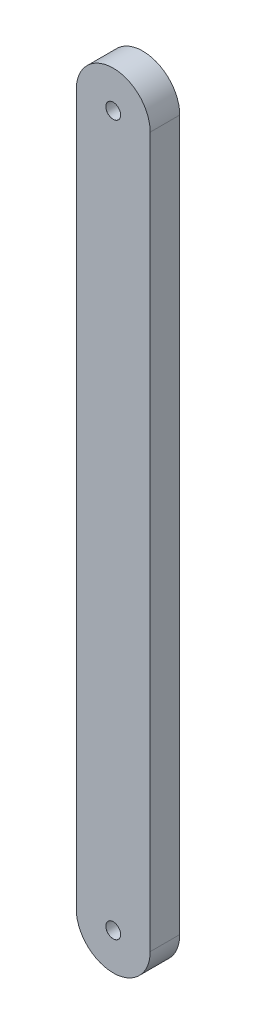
ISO-10303-21;
HEADER;
FILE_DESCRIPTION(('STEP AP214'),'2;1');
FILE_NAME('part.step','',(''),(''),'','','');
FILE_SCHEMA(('AUTOMOTIVE_DESIGN { 1 0 10303 214 1 1 1 1 }'));
ENDSEC;
DATA;
#1=APPLICATION_CONTEXT('core data for automotive mechanical design processes');
#2=APPLICATION_PROTOCOL_DEFINITION('international standard','automotive_design',2000,#1);
#3=PRODUCT_CONTEXT('',#1,'mechanical');
#4=PRODUCT('Part','Part','',(#3));
#5=PRODUCT_RELATED_PRODUCT_CATEGORY('part','',(#4));
#6=PRODUCT_DEFINITION_FORMATION('','',#4);
#7=PRODUCT_DEFINITION_CONTEXT('part definition',#1,'design');
#8=PRODUCT_DEFINITION('design','',#6,#7);
#9=PRODUCT_DEFINITION_SHAPE('','',#8);
#10=(LENGTH_UNIT() NAMED_UNIT(*) SI_UNIT(.MILLI.,.METRE.));
#11=(NAMED_UNIT(*) PLANE_ANGLE_UNIT() SI_UNIT($,.RADIAN.));
#12=(NAMED_UNIT(*) SI_UNIT($,.STERADIAN.) SOLID_ANGLE_UNIT());
#13=UNCERTAINTY_MEASURE_WITH_UNIT(LENGTH_MEASURE(1.E-05),#10,'distance_accuracy_value','');
#14=(GEOMETRIC_REPRESENTATION_CONTEXT(3) GLOBAL_UNCERTAINTY_ASSIGNED_CONTEXT((#13)) GLOBAL_UNIT_ASSIGNED_CONTEXT((#10,
#11,#12)) REPRESENTATION_CONTEXT('',''));
#15=CARTESIAN_POINT('',(0.,0.,0.));
#16=DIRECTION('',(0.,0.,1.));
#17=DIRECTION('',(1.,0.,0.));
#18=AXIS2_PLACEMENT_3D('',#15,#16,#17);
#19=CARTESIAN_POINT('',(25.,0.,20.));
#20=DIRECTION('',(0.,0.,-1.));
#21=DIRECTION('',(-1.,0.,0.));
#22=AXIS2_PLACEMENT_3D('',#19,#20,#21);
#23=PLANE('',#22);
#24=CARTESIAN_POINT('',(25.,0.,20.));
#25=DIRECTION('',(0.,0.,1.));
#26=DIRECTION('',(-1.,0.,0.));
#27=AXIS2_PLACEMENT_3D('',#24,#25,#26);
#28=CIRCLE('',#27,25.);
#29=CARTESIAN_POINT('',(0.,0.,20.));
#30=VERTEX_POINT('',#29);
#31=CARTESIAN_POINT('',(50.,0.,20.));
#32=VERTEX_POINT('',#31);
#33=EDGE_CURVE('E85',#30,#32,#28,.T.);
#34=ORIENTED_EDGE('',*,*,#33,.T.);
#35=DIRECTION('',(0.,1.,0.));
#36=VECTOR('',#35,1.);
#37=CARTESIAN_POINT('',(50.,480.,20.));
#38=LINE('',#37,#36);
#39=CARTESIAN_POINT('',(50.,480.,20.));
#40=VERTEX_POINT('',#39);
#41=EDGE_CURVE('E80',#32,#40,#38,.T.);
#42=ORIENTED_EDGE('',*,*,#41,.T.);
#43=CARTESIAN_POINT('',(25.,480.,20.));
#44=DIRECTION('',(0.,0.,1.));
#45=DIRECTION('',(-1.,0.,0.));
#46=AXIS2_PLACEMENT_3D('',#43,#44,#45);
#47=CIRCLE('',#46,25.);
#48=CARTESIAN_POINT('',(0.,480.,20.));
#49=VERTEX_POINT('',#48);
#50=EDGE_CURVE('E83',#40,#49,#47,.T.);
#51=ORIENTED_EDGE('',*,*,#50,.T.);
#52=DIRECTION('',(0.,-1.,0.));
#53=VECTOR('',#52,1.);
#54=CARTESIAN_POINT('',(0.,0.,20.));
#55=LINE('',#54,#53);
#56=EDGE_CURVE('E50',#49,#30,#55,.T.);
#57=ORIENTED_EDGE('',*,*,#56,.T.);
#58=EDGE_LOOP('',(#34,#42,#51,#57));
#59=FACE_BOUND('',#58,.T.);
#60=CARTESIAN_POINT('',(25.,0.,20.));
#61=DIRECTION('',(0.,0.,1.));
#62=DIRECTION('',(1.,0.,0.));
#63=AXIS2_PLACEMENT_3D('',#60,#61,#62);
#64=CIRCLE('',#63,5.025);
#65=CARTESIAN_POINT('',(30.025,0.,20.));
#66=VERTEX_POINT('',#65);
#67=EDGE_CURVE('E116',#66,#66,#64,.T.);
#68=ORIENTED_EDGE('',*,*,#67,.F.);
#69=EDGE_LOOP('',(#68));
#70=FACE_BOUND('',#69,.T.);
#71=CARTESIAN_POINT('',(25.,480.,20.));
#72=DIRECTION('',(0.,0.,1.));
#73=DIRECTION('',(1.,0.,0.));
#74=AXIS2_PLACEMENT_3D('',#71,#72,#73);
#75=CIRCLE('',#74,5.025);
#76=CARTESIAN_POINT('',(30.025,480.,20.));
#77=VERTEX_POINT('',#76);
#78=EDGE_CURVE('E125',#77,#77,#75,.T.);
#79=ORIENTED_EDGE('',*,*,#78,.F.);
#80=EDGE_LOOP('',(#79));
#81=FACE_BOUND('',#80,.T.);
#82=ADVANCED_FACE('F33',(#59,#70,#81),#23,.F.);
#83=CARTESIAN_POINT('',(25.,0.,20.));
#84=DIRECTION('',(0.,0.,-1.));
#85=DIRECTION('',(-1.,0.,0.));
#86=AXIS2_PLACEMENT_3D('',#83,#84,#85);
#87=CYLINDRICAL_SURFACE('',#86,25.);
#88=CARTESIAN_POINT('',(25.,0.,0.));
#89=DIRECTION('',(0.,0.,1.));
#90=DIRECTION('',(-1.,0.,0.));
#91=AXIS2_PLACEMENT_3D('',#88,#89,#90);
#92=CIRCLE('',#91,25.);
#93=CARTESIAN_POINT('',(0.,0.,0.));
#94=VERTEX_POINT('',#93);
#95=CARTESIAN_POINT('',(50.,0.,0.));
#96=VERTEX_POINT('',#95);
#97=EDGE_CURVE('E97',#94,#96,#92,.T.);
#98=ORIENTED_EDGE('',*,*,#97,.T.);
#99=DIRECTION('',(0.,0.,-1.));
#100=VECTOR('',#99,1.);
#101=CARTESIAN_POINT('',(50.,0.,20.));
#102=LINE('',#101,#100);
#103=EDGE_CURVE('E11',#32,#96,#102,.T.);
#104=ORIENTED_EDGE('',*,*,#103,.F.);
#105=ORIENTED_EDGE('',*,*,#33,.F.);
#106=DIRECTION('',(0.,0.,-1.));
#107=VECTOR('',#106,1.);
#108=CARTESIAN_POINT('',(0.,0.,20.));
#109=LINE('',#108,#107);
#110=EDGE_CURVE('E93',#30,#94,#109,.T.);
#111=ORIENTED_EDGE('',*,*,#110,.T.);
#112=EDGE_LOOP('',(#98,#104,#105,#111));
#113=FACE_BOUND('',#112,.T.);
#114=ADVANCED_FACE('F35',(#113),#87,.T.);
#115=CARTESIAN_POINT('',(50.,480.,20.));
#116=DIRECTION('',(-1.,0.,0.));
#117=DIRECTION('',(0.,0.,1.));
#118=AXIS2_PLACEMENT_3D('',#115,#116,#117);
#119=PLANE('',#118);
#120=DIRECTION('',(0.,1.,0.));
#121=VECTOR('',#120,1.);
#122=CARTESIAN_POINT('',(50.,480.,0.));
#123=LINE('',#122,#121);
#124=CARTESIAN_POINT('',(50.,480.,0.));
#125=VERTEX_POINT('',#124);
#126=EDGE_CURVE('E89',#96,#125,#123,.T.);
#127=ORIENTED_EDGE('',*,*,#126,.T.);
#128=DIRECTION('',(0.,0.,-1.));
#129=VECTOR('',#128,1.);
#130=CARTESIAN_POINT('',(50.,480.,20.));
#131=LINE('',#130,#129);
#132=EDGE_CURVE('E42',#40,#125,#131,.T.);
#133=ORIENTED_EDGE('',*,*,#132,.F.);
#134=ORIENTED_EDGE('',*,*,#41,.F.);
#135=ORIENTED_EDGE('',*,*,#103,.T.);
#136=EDGE_LOOP('',(#127,#133,#134,#135));
#137=FACE_BOUND('',#136,.T.);
#138=ADVANCED_FACE('F88',(#137),#119,.F.);
#139=CARTESIAN_POINT('',(25.,480.,20.));
#140=DIRECTION('',(0.,0.,-1.));
#141=DIRECTION('',(-1.,0.,0.));
#142=AXIS2_PLACEMENT_3D('',#139,#140,#141);
#143=CYLINDRICAL_SURFACE('',#142,25.);
#144=CARTESIAN_POINT('',(25.,480.,0.));
#145=DIRECTION('',(0.,0.,1.));
#146=DIRECTION('',(-1.,0.,0.));
#147=AXIS2_PLACEMENT_3D('',#144,#145,#146);
#148=CIRCLE('',#147,25.);
#149=CARTESIAN_POINT('',(0.,480.,0.));
#150=VERTEX_POINT('',#149);
#151=EDGE_CURVE('E67',#125,#150,#148,.T.);
#152=ORIENTED_EDGE('',*,*,#151,.T.);
#153=DIRECTION('',(0.,0.,-1.));
#154=VECTOR('',#153,1.);
#155=CARTESIAN_POINT('',(0.,480.,20.));
#156=LINE('',#155,#154);
#157=EDGE_CURVE('E90',#49,#150,#156,.T.);
#158=ORIENTED_EDGE('',*,*,#157,.F.);
#159=ORIENTED_EDGE('',*,*,#50,.F.);
#160=ORIENTED_EDGE('',*,*,#132,.T.);
#161=EDGE_LOOP('',(#152,#158,#159,#160));
#162=FACE_BOUND('',#161,.T.);
#163=ADVANCED_FACE('F91',(#162),#143,.T.);
#164=CARTESIAN_POINT('',(0.,0.,20.));
#165=DIRECTION('',(1.,0.,0.));
#166=DIRECTION('',(0.,0.,-1.));
#167=AXIS2_PLACEMENT_3D('',#164,#165,#166);
#168=PLANE('',#167);
#169=DIRECTION('',(0.,-1.,0.));
#170=VECTOR('',#169,1.);
#171=CARTESIAN_POINT('',(0.,0.,0.));
#172=LINE('',#171,#170);
#173=EDGE_CURVE('E73',#150,#94,#172,.T.);
#174=ORIENTED_EDGE('',*,*,#173,.T.);
#175=ORIENTED_EDGE('',*,*,#110,.F.);
#176=ORIENTED_EDGE('',*,*,#56,.F.);
#177=ORIENTED_EDGE('',*,*,#157,.T.);
#178=EDGE_LOOP('',(#174,#175,#176,#177));
#179=FACE_BOUND('',#178,.T.);
#180=ADVANCED_FACE('F105',(#179),#168,.F.);
#181=CARTESIAN_POINT('',(25.,0.,0.));
#182=DIRECTION('',(0.,0.,-1.));
#183=DIRECTION('',(-1.,0.,0.));
#184=AXIS2_PLACEMENT_3D('',#181,#182,#183);
#185=PLANE('',#184);
#186=CARTESIAN_POINT('',(25.,480.,0.));
#187=DIRECTION('',(0.,0.,-1.));
#188=DIRECTION('',(-1.,0.,0.));
#189=AXIS2_PLACEMENT_3D('',#186,#187,#188);
#190=CIRCLE('',#189,5.);
#191=CARTESIAN_POINT('',(20.,480.,0.));
#192=VERTEX_POINT('',#191);
#193=EDGE_CURVE('E119',#192,#192,#190,.T.);
#194=ORIENTED_EDGE('',*,*,#193,.F.);
#195=EDGE_LOOP('',(#194));
#196=FACE_BOUND('',#195,.T.);
#197=CARTESIAN_POINT('',(25.,0.,0.));
#198=DIRECTION('',(0.,0.,-1.));
#199=DIRECTION('',(-1.,0.,0.));
#200=AXIS2_PLACEMENT_3D('',#197,#198,#199);
#201=CIRCLE('',#200,5.);
#202=CARTESIAN_POINT('',(20.,0.,0.));
#203=VERTEX_POINT('',#202);
#204=EDGE_CURVE('E100',#203,#203,#201,.T.);
#205=ORIENTED_EDGE('',*,*,#204,.F.);
#206=EDGE_LOOP('',(#205));
#207=FACE_BOUND('',#206,.T.);
#208=ORIENTED_EDGE('',*,*,#97,.F.);
#209=ORIENTED_EDGE('',*,*,#173,.F.);
#210=ORIENTED_EDGE('',*,*,#151,.F.);
#211=ORIENTED_EDGE('',*,*,#126,.F.);
#212=EDGE_LOOP('',(#208,#209,#210,#211));
#213=FACE_BOUND('',#212,.T.);
#214=ADVANCED_FACE('F108',(#196,#207,#213),#185,.T.);
#215=CARTESIAN_POINT('',(25.,0.,20.));
#216=DIRECTION('',(0.,0.,1.));
#217=DIRECTION('',(1.,0.,0.));
#218=AXIS2_PLACEMENT_3D('',#215,#216,#217);
#219=CYLINDRICAL_SURFACE('',#218,5.);
#220=CARTESIAN_POINT('',(25.,0.,19.975));
#221=DIRECTION('',(0.,0.,1.));
#222=DIRECTION('',(1.,0.,0.));
#223=AXIS2_PLACEMENT_3D('',#220,#221,#222);
#224=CIRCLE('',#223,5.);
#225=CARTESIAN_POINT('',(30.,0.,19.975));
#226=VERTEX_POINT('',#225);
#227=EDGE_CURVE('E113',#226,#226,#224,.T.);
#228=ORIENTED_EDGE('',*,*,#227,.T.);
#229=EDGE_LOOP('',(#228));
#230=FACE_BOUND('',#229,.T.);
#231=ORIENTED_EDGE('',*,*,#204,.T.);
#232=EDGE_LOOP('',(#231));
#233=FACE_BOUND('',#232,.T.);
#234=ADVANCED_FACE('F138',(#230,#233),#219,.F.);
#235=CARTESIAN_POINT('',(25.,0.,20.));
#236=DIRECTION('',(0.,0.,1.));
#237=DIRECTION('',(1.,0.,0.));
#238=AXIS2_PLACEMENT_3D('',#235,#236,#237);
#239=CONICAL_SURFACE('',#238,5.025,0.785398163397587);
#240=ORIENTED_EDGE('',*,*,#227,.F.);
#241=EDGE_LOOP('',(#240));
#242=FACE_BOUND('',#241,.T.);
#243=ORIENTED_EDGE('',*,*,#67,.T.);
#244=EDGE_LOOP('',(#243));
#245=FACE_BOUND('',#244,.T.);
#246=ADVANCED_FACE('F169',(#242,#245),#239,.F.);
#247=CARTESIAN_POINT('',(25.,480.,20.));
#248=DIRECTION('',(0.,0.,1.));
#249=DIRECTION('',(1.,0.,0.));
#250=AXIS2_PLACEMENT_3D('',#247,#248,#249);
#251=CYLINDRICAL_SURFACE('',#250,5.);
#252=CARTESIAN_POINT('',(25.,480.,19.975));
#253=DIRECTION('',(0.,0.,1.));
#254=DIRECTION('',(1.,0.,0.));
#255=AXIS2_PLACEMENT_3D('',#252,#253,#254);
#256=CIRCLE('',#255,5.);
#257=CARTESIAN_POINT('',(30.,480.,19.975));
#258=VERTEX_POINT('',#257);
#259=EDGE_CURVE('E122',#258,#258,#256,.T.);
#260=ORIENTED_EDGE('',*,*,#259,.T.);
#261=EDGE_LOOP('',(#260));
#262=FACE_BOUND('',#261,.T.);
#263=ORIENTED_EDGE('',*,*,#193,.T.);
#264=EDGE_LOOP('',(#263));
#265=FACE_BOUND('',#264,.T.);
#266=ADVANCED_FACE('F176',(#262,#265),#251,.F.);
#267=CARTESIAN_POINT('',(25.,480.,20.));
#268=DIRECTION('',(0.,0.,1.));
#269=DIRECTION('',(1.,0.,0.));
#270=AXIS2_PLACEMENT_3D('',#267,#268,#269);
#271=CONICAL_SURFACE('',#270,5.025,0.785398163397587);
#272=ORIENTED_EDGE('',*,*,#259,.F.);
#273=EDGE_LOOP('',(#272));
#274=FACE_BOUND('',#273,.T.);
#275=ORIENTED_EDGE('',*,*,#78,.T.);
#276=EDGE_LOOP('',(#275));
#277=FACE_BOUND('',#276,.T.);
#278=ADVANCED_FACE('F129',(#274,#277),#271,.F.);
#279=CLOSED_SHELL('',(#82,#114,#138,#163,#180,#214,#234,#246,#266,#278));
#280=MANIFOLD_SOLID_BREP('B2',#279);
#281=ADVANCED_BREP_SHAPE_REPRESENTATION('',(#18,#280),#14);
#282=SHAPE_DEFINITION_REPRESENTATION(#9,#281);
ENDSEC;
END-ISO-10303-21;
